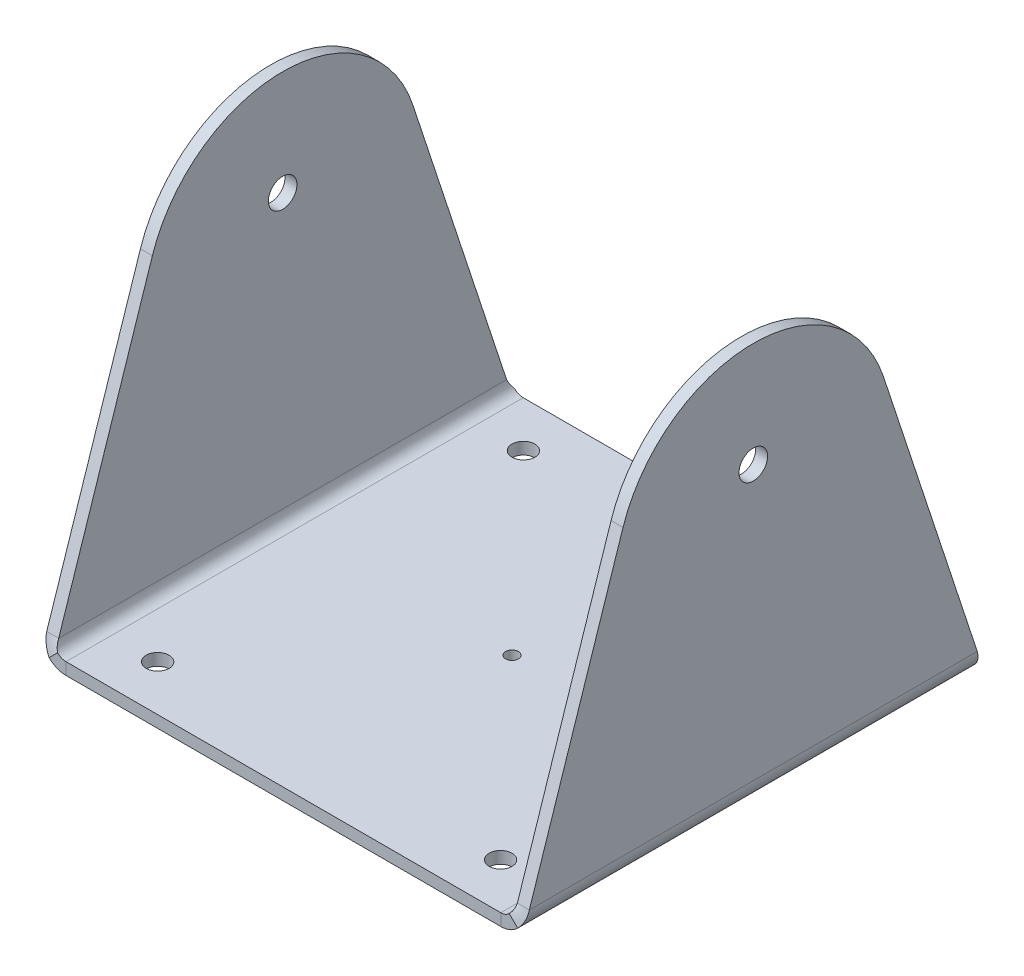
ISO-10303-21;
HEADER;
FILE_DESCRIPTION(('STEP AP214'),'2;1');
FILE_NAME('part.step','',(''),(''),'','','');
FILE_SCHEMA(('AUTOMOTIVE_DESIGN { 1 0 10303 214 1 1 1 1 }'));
ENDSEC;
DATA;
#1=APPLICATION_CONTEXT('core data for automotive mechanical design processes');
#2=APPLICATION_PROTOCOL_DEFINITION('international standard','automotive_design',2000,#1);
#3=PRODUCT_CONTEXT('',#1,'mechanical');
#4=PRODUCT('Part','Part','',(#3));
#5=PRODUCT_RELATED_PRODUCT_CATEGORY('part','',(#4));
#6=PRODUCT_DEFINITION_FORMATION('','',#4);
#7=PRODUCT_DEFINITION_CONTEXT('part definition',#1,'design');
#8=PRODUCT_DEFINITION('design','',#6,#7);
#9=PRODUCT_DEFINITION_SHAPE('','',#8);
#10=(LENGTH_UNIT() NAMED_UNIT(*) SI_UNIT(.MILLI.,.METRE.));
#11=(NAMED_UNIT(*) PLANE_ANGLE_UNIT() SI_UNIT($,.RADIAN.));
#12=(NAMED_UNIT(*) SI_UNIT($,.STERADIAN.) SOLID_ANGLE_UNIT());
#13=UNCERTAINTY_MEASURE_WITH_UNIT(LENGTH_MEASURE(1.E-05),#10,'distance_accuracy_value','');
#14=(GEOMETRIC_REPRESENTATION_CONTEXT(3) GLOBAL_UNCERTAINTY_ASSIGNED_CONTEXT((#13)) GLOBAL_UNIT_ASSIGNED_CONTEXT((#10,
#11,#12)) REPRESENTATION_CONTEXT('',''));
#15=CARTESIAN_POINT('',(0.,0.,0.));
#16=DIRECTION('',(0.,0.,1.));
#17=DIRECTION('',(1.,0.,0.));
#18=AXIS2_PLACEMENT_3D('',#15,#16,#17);
#19=CARTESIAN_POINT('',(-51.435,-2.65684,-50.8));
#20=DIRECTION('',(0.,0.,-1.));
#21=DIRECTION('',(-1.,0.,0.));
#22=AXIS2_PLACEMENT_3D('',#19,#20,#21);
#23=PLANE('',#22);
#24=DIRECTION('',(-1.,0.,0.));
#25=VECTOR('',#24,1.);
#26=CARTESIAN_POINT('',(-51.435,0.,-50.8));
#27=LINE('',#26,#25);
#28=CARTESIAN_POINT('',(48.3049841153387,0.,-50.8));
#29=VERTEX_POINT('',#28);
#30=CARTESIAN_POINT('',(-48.3049841153387,0.,-50.8));
#31=VERTEX_POINT('',#30);
#32=EDGE_CURVE('E95',#29,#31,#27,.T.);
#33=ORIENTED_EDGE('',*,*,#32,.F.);
#34=DIRECTION('',(0.,-1.,0.));
#35=VECTOR('',#34,1.);
#36=CARTESIAN_POINT('',(48.3049841153387,-2.65684,-50.8));
#37=LINE('',#36,#35);
#38=CARTESIAN_POINT('',(48.3049841153387,-2.65684,-50.8));
#39=VERTEX_POINT('',#38);
#40=EDGE_CURVE('E730',#29,#39,#37,.T.);
#41=ORIENTED_EDGE('',*,*,#40,.T.);
#42=DIRECTION('',(-1.,0.,0.));
#43=VECTOR('',#42,1.);
#44=CARTESIAN_POINT('',(-51.435,-2.65684,-50.8));
#45=LINE('',#44,#43);
#46=CARTESIAN_POINT('',(-48.3049841153387,-2.65684,-50.8));
#47=VERTEX_POINT('',#46);
#48=EDGE_CURVE('E672',#39,#47,#45,.T.);
#49=ORIENTED_EDGE('',*,*,#48,.T.);
#50=DIRECTION('',(0.,-1.,0.));
#51=VECTOR('',#50,1.);
#52=CARTESIAN_POINT('',(-48.3049841153387,-2.65684,-50.8));
#53=LINE('',#52,#51);
#54=EDGE_CURVE('E631',#31,#47,#53,.T.);
#55=ORIENTED_EDGE('',*,*,#54,.F.);
#56=EDGE_LOOP('',(#33,#41,#49,#55));
#57=FACE_BOUND('',#56,.T.);
#58=ADVANCED_FACE('F70',(#57),#23,.T.);
#59=CARTESIAN_POINT('',(-51.435,-2.65684,50.8));
#60=DIRECTION('',(0.,0.,1.));
#61=DIRECTION('',(1.,0.,0.));
#62=AXIS2_PLACEMENT_3D('',#59,#60,#61);
#63=PLANE('',#62);
#64=DIRECTION('',(1.,0.,0.));
#65=VECTOR('',#64,1.);
#66=CARTESIAN_POINT('',(-51.435,-2.65684,50.8));
#67=LINE('',#66,#65);
#68=CARTESIAN_POINT('',(-48.3049841153387,-2.65684,50.8));
#69=VERTEX_POINT('',#68);
#70=CARTESIAN_POINT('',(48.3049841153387,-2.65684,50.8));
#71=VERTEX_POINT('',#70);
#72=EDGE_CURVE('E663',#69,#71,#67,.T.);
#73=ORIENTED_EDGE('',*,*,#72,.T.);
#74=DIRECTION('',(0.,1.,0.));
#75=VECTOR('',#74,1.);
#76=CARTESIAN_POINT('',(48.3049841153387,-2.65684,50.8));
#77=LINE('',#76,#75);
#78=CARTESIAN_POINT('',(48.3049841153387,0.,50.8));
#79=VERTEX_POINT('',#78);
#80=EDGE_CURVE('E12',#71,#79,#77,.T.);
#81=ORIENTED_EDGE('',*,*,#80,.T.);
#82=DIRECTION('',(1.,0.,0.));
#83=VECTOR('',#82,1.);
#84=CARTESIAN_POINT('',(-51.435,0.,50.8));
#85=LINE('',#84,#83);
#86=CARTESIAN_POINT('',(-48.3049841153387,0.,50.8));
#87=VERTEX_POINT('',#86);
#88=EDGE_CURVE('E676',#87,#79,#85,.T.);
#89=ORIENTED_EDGE('',*,*,#88,.F.);
#90=DIRECTION('',(0.,1.,0.));
#91=VECTOR('',#90,1.);
#92=CARTESIAN_POINT('',(-48.3049841153386,-2.65684,50.8));
#93=LINE('',#92,#91);
#94=EDGE_CURVE('E628',#69,#87,#93,.T.);
#95=ORIENTED_EDGE('',*,*,#94,.F.);
#96=EDGE_LOOP('',(#73,#81,#89,#95));
#97=FACE_BOUND('',#96,.T.);
#98=ADVANCED_FACE('F723',(#97),#63,.T.);
#99=CARTESIAN_POINT('',(-108.245323885716,-2.65684,0.));
#100=DIRECTION('',(0.,-1.,0.));
#101=DIRECTION('',(0.,0.,-1.));
#102=AXIS2_PLACEMENT_3D('',#99,#100,#101);
#103=PLANE('',#102);
#104=CARTESIAN_POINT('',(0.,-2.65684,0.));
#105=DIRECTION('',(0.,-1.,0.));
#106=DIRECTION('',(0.,0.,-1.));
#107=AXIS2_PLACEMENT_3D('',#104,#105,#106);
#108=CIRCLE('',#107,1.4224);
#109=CARTESIAN_POINT('',(0.,-2.65684,-1.4224));
#110=VERTEX_POINT('',#109);
#111=EDGE_CURVE('E805',#110,#110,#108,.T.);
#112=ORIENTED_EDGE('',*,*,#111,.F.);
#113=EDGE_LOOP('',(#112));
#114=FACE_BOUND('',#113,.T.);
#115=CARTESIAN_POINT('',(38.1,-2.65684,-40.64));
#116=DIRECTION('',(0.,-1.,0.));
#117=DIRECTION('',(0.,0.,-1.));
#118=AXIS2_PLACEMENT_3D('',#115,#116,#117);
#119=CIRCLE('',#118,2.54);
#120=CARTESIAN_POINT('',(38.1,-2.65684,-43.18));
#121=VERTEX_POINT('',#120);
#122=EDGE_CURVE('E802',#121,#121,#119,.T.);
#123=ORIENTED_EDGE('',*,*,#122,.F.);
#124=EDGE_LOOP('',(#123));
#125=FACE_BOUND('',#124,.T.);
#126=CARTESIAN_POINT('',(38.1,-2.65684,40.64));
#127=DIRECTION('',(0.,-1.,0.));
#128=DIRECTION('',(0.,0.,-1.));
#129=AXIS2_PLACEMENT_3D('',#126,#127,#128);
#130=CIRCLE('',#129,2.54);
#131=CARTESIAN_POINT('',(38.1,-2.65684,38.1));
#132=VERTEX_POINT('',#131);
#133=EDGE_CURVE('E799',#132,#132,#130,.T.);
#134=ORIENTED_EDGE('',*,*,#133,.F.);
#135=EDGE_LOOP('',(#134));
#136=FACE_BOUND('',#135,.T.);
#137=CARTESIAN_POINT('',(-38.1,-2.65684,40.64));
#138=DIRECTION('',(0.,-1.,0.));
#139=DIRECTION('',(0.,0.,-1.));
#140=AXIS2_PLACEMENT_3D('',#137,#138,#139);
#141=CIRCLE('',#140,2.54);
#142=CARTESIAN_POINT('',(-38.1,-2.65684,38.1));
#143=VERTEX_POINT('',#142);
#144=EDGE_CURVE('E776',#143,#143,#141,.T.);
#145=ORIENTED_EDGE('',*,*,#144,.F.);
#146=EDGE_LOOP('',(#145));
#147=FACE_BOUND('',#146,.T.);
#148=CARTESIAN_POINT('',(-38.1,-2.65684,-40.64));
#149=DIRECTION('',(0.,-1.,0.));
#150=DIRECTION('',(0.,0.,-1.));
#151=AXIS2_PLACEMENT_3D('',#148,#149,#150);
#152=CIRCLE('',#151,2.54);
#153=CARTESIAN_POINT('',(-38.1,-2.65684,-43.18));
#154=VERTEX_POINT('',#153);
#155=EDGE_CURVE('E785',#154,#154,#152,.T.);
#156=ORIENTED_EDGE('',*,*,#155,.F.);
#157=EDGE_LOOP('',(#156));
#158=FACE_BOUND('',#157,.T.);
#159=ORIENTED_EDGE('',*,*,#48,.F.);
#160=DIRECTION('',(0.,0.,1.));
#161=VECTOR('',#160,1.);
#162=CARTESIAN_POINT('',(48.3049841153387,-2.65684,0.));
#163=LINE('',#162,#161);
#164=EDGE_CURVE('E431',#39,#71,#163,.T.);
#165=ORIENTED_EDGE('',*,*,#164,.T.);
#166=ORIENTED_EDGE('',*,*,#72,.F.);
#167=DIRECTION('',(0.,0.,1.));
#168=VECTOR('',#167,1.);
#169=CARTESIAN_POINT('',(-48.3049841153387,-2.65684,0.));
#170=LINE('',#169,#168);
#171=EDGE_CURVE('E662',#47,#69,#170,.T.);
#172=ORIENTED_EDGE('',*,*,#171,.F.);
#173=EDGE_LOOP('',(#159,#165,#166,#172));
#174=FACE_BOUND('',#173,.T.);
#175=ADVANCED_FACE('F728',(#114,#125,#136,#147,#158,#174),#103,.T.);
#176=CARTESIAN_POINT('',(-108.245323885716,0.,0.));
#177=DIRECTION('',(0.,-1.,0.));
#178=DIRECTION('',(0.,0.,-1.));
#179=AXIS2_PLACEMENT_3D('',#176,#177,#178);
#180=PLANE('',#179);
#181=CARTESIAN_POINT('',(0.,0.,0.));
#182=DIRECTION('',(0.,1.,0.));
#183=DIRECTION('',(0.,0.,1.));
#184=AXIS2_PLACEMENT_3D('',#181,#182,#183);
#185=CIRCLE('',#184,1.4224);
#186=CARTESIAN_POINT('',(0.,0.,1.4224));
#187=VERTEX_POINT('',#186);
#188=EDGE_CURVE('E793',#187,#187,#185,.T.);
#189=ORIENTED_EDGE('',*,*,#188,.F.);
#190=EDGE_LOOP('',(#189));
#191=FACE_BOUND('',#190,.T.);
#192=CARTESIAN_POINT('',(38.1,0.,-40.64));
#193=DIRECTION('',(0.,1.,0.));
#194=DIRECTION('',(0.,0.,1.));
#195=AXIS2_PLACEMENT_3D('',#192,#193,#194);
#196=CIRCLE('',#195,2.54);
#197=CARTESIAN_POINT('',(38.1,0.,-38.1));
#198=VERTEX_POINT('',#197);
#199=EDGE_CURVE('E788',#198,#198,#196,.T.);
#200=ORIENTED_EDGE('',*,*,#199,.F.);
#201=EDGE_LOOP('',(#200));
#202=FACE_BOUND('',#201,.T.);
#203=CARTESIAN_POINT('',(38.1,0.,40.64));
#204=DIRECTION('',(0.,1.,0.));
#205=DIRECTION('',(0.,0.,1.));
#206=AXIS2_PLACEMENT_3D('',#203,#204,#205);
#207=CIRCLE('',#206,2.54);
#208=CARTESIAN_POINT('',(38.1,0.,43.18));
#209=VERTEX_POINT('',#208);
#210=EDGE_CURVE('E782',#209,#209,#207,.T.);
#211=ORIENTED_EDGE('',*,*,#210,.F.);
#212=EDGE_LOOP('',(#211));
#213=FACE_BOUND('',#212,.T.);
#214=CARTESIAN_POINT('',(-38.1,0.,40.64));
#215=DIRECTION('',(0.,1.,0.));
#216=DIRECTION('',(0.,0.,1.));
#217=AXIS2_PLACEMENT_3D('',#214,#215,#216);
#218=CIRCLE('',#217,2.54);
#219=CARTESIAN_POINT('',(-38.1,0.,43.18));
#220=VERTEX_POINT('',#219);
#221=EDGE_CURVE('E779',#220,#220,#218,.T.);
#222=ORIENTED_EDGE('',*,*,#221,.F.);
#223=EDGE_LOOP('',(#222));
#224=FACE_BOUND('',#223,.T.);
#225=CARTESIAN_POINT('',(-38.1,0.,-40.64));
#226=DIRECTION('',(0.,1.,0.));
#227=DIRECTION('',(0.,0.,1.));
#228=AXIS2_PLACEMENT_3D('',#225,#226,#227);
#229=CIRCLE('',#228,2.54);
#230=CARTESIAN_POINT('',(-38.1,0.,-38.1));
#231=VERTEX_POINT('',#230);
#232=EDGE_CURVE('E781',#231,#231,#229,.T.);
#233=ORIENTED_EDGE('',*,*,#232,.F.);
#234=EDGE_LOOP('',(#233));
#235=FACE_BOUND('',#234,.T.);
#236=DIRECTION('',(0.,0.,1.));
#237=VECTOR('',#236,1.);
#238=CARTESIAN_POINT('',(48.3049841153387,0.,0.));
#239=LINE('',#238,#237);
#240=EDGE_CURVE('E79',#29,#79,#239,.T.);
#241=ORIENTED_EDGE('',*,*,#240,.F.);
#242=ORIENTED_EDGE('',*,*,#32,.T.);
#243=DIRECTION('',(0.,0.,1.));
#244=VECTOR('',#243,1.);
#245=CARTESIAN_POINT('',(-48.3049841153387,0.,0.));
#246=LINE('',#245,#244);
#247=EDGE_CURVE('E629',#31,#87,#246,.T.);
#248=ORIENTED_EDGE('',*,*,#247,.T.);
#249=ORIENTED_EDGE('',*,*,#88,.T.);
#250=EDGE_LOOP('',(#241,#242,#248,#249));
#251=FACE_BOUND('',#250,.T.);
#252=ADVANCED_FACE('F72',(#191,#202,#213,#224,#235,#251),#180,.F.);
#253=CARTESIAN_POINT('',(-53.6186641153387,2.65684,-49.7691780533468));
#254=CARTESIAN_POINT('',(-53.6186641153387,1.96116271819733,-49.9410109057097));
#255=CARTESIAN_POINT('',(-53.4803632478976,1.26599550183778,-50.1127853688979));
#256=CARTESIAN_POINT('',(-52.9480053714089,-0.0192301036172334,-50.4563926844489));
#257=CARTESIAN_POINT('',(-52.5542413998741,-0.608581037575227,-50.628167147637));
#258=CARTESIAN_POINT('',(-52.062323276394,-1.10049916105532,-50.8));
#259=CARTESIAN_POINT('',(-50.9618241153387,2.65684,-49.7691780533468));
#260=CARTESIAN_POINT('',(-50.9618241153387,2.30901005387616,-49.9410066104756));
#261=CARTESIAN_POINT('',(-50.8926736816181,1.96141775091889,-50.1127853688979));
#262=CARTESIAN_POINT('',(-50.6264947433738,1.31880494819138,-50.4563926844489));
#263=CARTESIAN_POINT('',(-50.4296066094703,1.02412333307626,-50.6281714428712));
#264=CARTESIAN_POINT('',(-50.1836536958663,0.778170419472337,-50.8));
#265=B_SPLINE_SURFACE_WITH_KNOTS('',1,3,((#253,#254,#255,#256,#257,#258),(#259,#260,#261,#262,
#263,#264)),.UNSPECIFIED.,.F.,.F.,.F.,(2,2),(4,2,4),(0.,1.),(0.,0.5,1.),.UNSPECIFIED.);
#266=CARTESIAN_POINT('',(-53.6186641153387,2.65684,-49.7691780533468));
#267=CARTESIAN_POINT('',(-50.9618241153387,2.65684,-49.7691780533468));
#268=B_SPLINE_CURVE_WITH_KNOTS('',1,(#266,#267),.UNSPECIFIED.,.F.,.F.,(2,2),(0.,1.),.UNSPECIFIED.);
#269=CARTESIAN_POINT('',(-50.9618241153387,2.65684000000001,-49.7691780533468));
#270=VERTEX_POINT('',#269);
#271=CARTESIAN_POINT('',(-53.6186641153387,2.65684000000003,-49.7691780533468));
#272=VERTEX_POINT('',#271);
#273=EDGE_CURVE('E415',#270,#272,#268,.F.);
#274=CARTESIAN_POINT('',(-50.9618241153387,2.65684,-49.7691780533468));
#275=CARTESIAN_POINT('',(-50.9618241153387,2.30901005387616,-49.9410066104756));
#276=CARTESIAN_POINT('',(-50.8926736816181,1.96141775091889,-50.1127853688979));
#277=CARTESIAN_POINT('',(-50.6264947433738,1.31880494819138,-50.4563926844489));
#278=CARTESIAN_POINT('',(-50.4296066094703,1.02412333307626,-50.6281714428712));
#279=CARTESIAN_POINT('',(-50.1836536958663,0.778170419472337,-50.8));
#280=B_SPLINE_CURVE_WITH_KNOTS('',3,(#274,#275,#276,#277,#278,#279),.UNSPECIFIED.,.F.,.F.,(4,2,
4),(0.,0.5,1.),.UNSPECIFIED.);
#281=CARTESIAN_POINT('',(-50.1836536958663,0.778170419472338,-50.8));
#282=VERTEX_POINT('',#281);
#283=EDGE_CURVE('E589',#270,#282,#280,.T.);
#284=CARTESIAN_POINT('',(-50.1836536958663,0.778170419472337,-50.8));
#285=CARTESIAN_POINT('',(-52.062323276394,-1.10049916105532,-50.8));
#286=B_SPLINE_CURVE_WITH_KNOTS('',1,(#284,#285),.UNSPECIFIED.,.F.,.F.,(2,2),(0.,1.),.UNSPECIFIED.);
#287=CARTESIAN_POINT('',(-52.062323276394,-1.10049916105532,-50.8));
#288=VERTEX_POINT('',#287);
#289=EDGE_CURVE('E625',#282,#288,#286,.T.);
#290=CARTESIAN_POINT('',(-52.062323276394,-1.10049916105532,-50.8));
#291=CARTESIAN_POINT('',(-52.5542413998741,-0.608581037575227,-50.628167147637));
#292=CARTESIAN_POINT('',(-52.9480053714089,-0.0192301036172334,-50.4563926844489));
#293=CARTESIAN_POINT('',(-53.4803632478976,1.26599550183778,-50.1127853688979));
#294=CARTESIAN_POINT('',(-53.6186641153387,1.96116271819733,-49.9410109057097));
#295=CARTESIAN_POINT('',(-53.6186641153387,2.65684,-49.7691780533468));
#296=B_SPLINE_CURVE_WITH_KNOTS('',3,(#290,#291,#292,#293,#294,#295),.UNSPECIFIED.,.F.,.F.,(4,2,
4),(0.,0.5,1.),.UNSPECIFIED.);
#297=EDGE_CURVE('E591',#272,#288,#296,.F.);
#298=ORIENTED_EDGE('',*,*,#273,.F.);
#299=ORIENTED_EDGE('',*,*,#283,.T.);
#300=ORIENTED_EDGE('',*,*,#289,.T.);
#301=ORIENTED_EDGE('',*,*,#297,.F.);
#302=EDGE_LOOP('',(#298,#299,#300,#301));
#303=FACE_BOUND('',#302,.T.);
#304=ADVANCED_FACE('F520',(#303),#265,.T.);
#305=CARTESIAN_POINT('',(-48.3049841153387,2.65684,-50.8));
#306=DIRECTION('',(0.,0.,-1.));
#307=DIRECTION('',(-1.,0.,0.));
#308=AXIS2_PLACEMENT_3D('',#305,#306,#307);
#309=PLANE('',#308);
#310=ORIENTED_EDGE('',*,*,#289,.F.);
#311=CARTESIAN_POINT('',(-48.3049841153387,2.65684,-50.8));
#312=DIRECTION('',(0.,0.,-1.));
#313=DIRECTION('',(-1.,0.,0.));
#314=AXIS2_PLACEMENT_3D('',#311,#312,#313);
#315=CIRCLE('',#314,2.65684);
#316=EDGE_CURVE('E498',#282,#31,#315,.F.);
#317=ORIENTED_EDGE('',*,*,#316,.T.);
#318=ORIENTED_EDGE('',*,*,#54,.T.);
#319=CARTESIAN_POINT('',(-48.3049841153387,2.65684,-50.8));
#320=DIRECTION('',(0.,0.,1.));
#321=DIRECTION('',(-1.,0.,0.));
#322=AXIS2_PLACEMENT_3D('',#319,#320,#321);
#323=CIRCLE('',#322,5.31368);
#324=EDGE_CURVE('E478',#288,#47,#323,.T.);
#325=ORIENTED_EDGE('',*,*,#324,.F.);
#326=EDGE_LOOP('',(#310,#317,#318,#325));
#327=FACE_BOUND('',#326,.T.);
#328=ADVANCED_FACE('F563',(#327),#309,.T.);
#329=CARTESIAN_POINT('',(-48.3049841153386,2.65684,50.8));
#330=DIRECTION('',(0.,0.,1.));
#331=DIRECTION('',(1.,0.,0.));
#332=AXIS2_PLACEMENT_3D('',#329,#330,#331);
#333=PLANE('',#332);
#334=ORIENTED_EDGE('',*,*,#94,.T.);
#335=CARTESIAN_POINT('',(-48.3049841153386,2.65684,50.8));
#336=DIRECTION('',(0.,0.,-1.));
#337=DIRECTION('',(-1.,0.,0.));
#338=AXIS2_PLACEMENT_3D('',#335,#336,#337);
#339=CIRCLE('',#338,2.65684);
#340=CARTESIAN_POINT('',(-50.1836536958663,0.778170419472338,50.8));
#341=VERTEX_POINT('',#340);
#342=EDGE_CURVE('E490',#87,#341,#339,.T.);
#343=ORIENTED_EDGE('',*,*,#342,.T.);
#344=CARTESIAN_POINT('',(-52.062323276394,-1.10049916105533,50.8));
#345=CARTESIAN_POINT('',(-50.1836536958663,0.778170419472335,50.8));
#346=B_SPLINE_CURVE_WITH_KNOTS('',1,(#344,#345),.UNSPECIFIED.,.F.,.F.,(2,2),(0.,1.),.UNSPECIFIED.);
#347=CARTESIAN_POINT('',(-52.062323276394,-1.10049916105533,50.8));
#348=VERTEX_POINT('',#347);
#349=EDGE_CURVE('E552',#341,#348,#346,.F.);
#350=ORIENTED_EDGE('',*,*,#349,.T.);
#351=CARTESIAN_POINT('',(-48.3049841153386,2.65684,50.8));
#352=DIRECTION('',(0.,0.,-1.));
#353=DIRECTION('',(1.,0.,0.));
#354=AXIS2_PLACEMENT_3D('',#351,#352,#353);
#355=CIRCLE('',#354,5.31368);
#356=EDGE_CURVE('E476',#69,#348,#355,.T.);
#357=ORIENTED_EDGE('',*,*,#356,.F.);
#358=EDGE_LOOP('',(#334,#343,#350,#357));
#359=FACE_BOUND('',#358,.T.);
#360=ADVANCED_FACE('F519',(#359),#333,.T.);
#361=CARTESIAN_POINT('',(-52.062323276394,-1.10049916105533,50.8));
#362=CARTESIAN_POINT('',(-52.5542413998741,-0.608581037575227,50.628167147637));
#363=CARTESIAN_POINT('',(-52.9480053714089,-0.0192301036172348,50.4563926844489));
#364=CARTESIAN_POINT('',(-53.4803632478975,1.26599550183779,50.1127853688978));
#365=CARTESIAN_POINT('',(-53.6186641153387,1.96116271819732,49.9410109057097));
#366=CARTESIAN_POINT('',(-53.6186641153387,2.65684,49.7691780533468));
#367=CARTESIAN_POINT('',(-50.1836536958663,0.778170419472335,50.8));
#368=CARTESIAN_POINT('',(-50.4296066094702,1.02412333307626,50.6281714428712));
#369=CARTESIAN_POINT('',(-50.6264947433738,1.31880494819138,50.4563926844489));
#370=CARTESIAN_POINT('',(-50.8926736816181,1.96141775091889,50.1127853688978));
#371=CARTESIAN_POINT('',(-50.9618241153387,2.30901005387616,49.9410066104755));
#372=CARTESIAN_POINT('',(-50.9618241153387,2.65684,49.7691780533468));
#373=B_SPLINE_SURFACE_WITH_KNOTS('',1,3,((#361,#362,#363,#364,#365,#366),(#367,#368,#369,#370,
#371,#372)),.UNSPECIFIED.,.F.,.F.,.F.,(2,2),(4,2,4),(0.,1.),(0.,0.5,1.),.UNSPECIFIED.);
#374=CARTESIAN_POINT('',(-50.1836536958663,0.778170419472335,50.8));
#375=CARTESIAN_POINT('',(-50.4296066094702,1.02412333307626,50.6281714428712));
#376=CARTESIAN_POINT('',(-50.6264947433738,1.31880494819138,50.4563926844489));
#377=CARTESIAN_POINT('',(-50.8926736816181,1.96141775091889,50.1127853688978));
#378=CARTESIAN_POINT('',(-50.9618241153387,2.30901005387616,49.9410066104755));
#379=CARTESIAN_POINT('',(-50.9618241153387,2.65684,49.7691780533468));
#380=B_SPLINE_CURVE_WITH_KNOTS('',3,(#374,#375,#376,#377,#378,#379),.UNSPECIFIED.,.F.,.F.,(4,2,
4),(0.,0.5,1.),.UNSPECIFIED.);
#381=CARTESIAN_POINT('',(-50.9618241153387,2.65684,49.7691780533468));
#382=VERTEX_POINT('',#381);
#383=EDGE_CURVE('E486',#341,#382,#380,.T.);
#384=CARTESIAN_POINT('',(-50.9618241153387,2.65684,49.7691780533468));
#385=CARTESIAN_POINT('',(-53.6186641153387,2.65684,49.7691780533468));
#386=B_SPLINE_CURVE_WITH_KNOTS('',1,(#384,#385),.UNSPECIFIED.,.F.,.F.,(2,2),(0.,1.),.UNSPECIFIED.);
#387=CARTESIAN_POINT('',(-53.6186641153387,2.65684000000004,49.7691780533468));
#388=VERTEX_POINT('',#387);
#389=EDGE_CURVE('E421',#388,#382,#386,.F.);
#390=CARTESIAN_POINT('',(-53.6186641153387,2.65684,49.7691780533468));
#391=CARTESIAN_POINT('',(-53.6186641153387,1.96116271819732,49.9410109057097));
#392=CARTESIAN_POINT('',(-53.4803632478975,1.26599550183779,50.1127853688978));
#393=CARTESIAN_POINT('',(-52.9480053714089,-0.0192301036172348,50.4563926844489));
#394=CARTESIAN_POINT('',(-52.5542413998741,-0.608581037575227,50.628167147637));
#395=CARTESIAN_POINT('',(-52.062323276394,-1.10049916105533,50.8));
#396=B_SPLINE_CURVE_WITH_KNOTS('',3,(#390,#391,#392,#393,#394,#395),.UNSPECIFIED.,.F.,.F.,(4,2,
4),(0.,0.5,1.),.UNSPECIFIED.);
#397=EDGE_CURVE('E475',#348,#388,#396,.F.);
#398=ORIENTED_EDGE('',*,*,#383,.T.);
#399=ORIENTED_EDGE('',*,*,#389,.F.);
#400=ORIENTED_EDGE('',*,*,#397,.F.);
#401=ORIENTED_EDGE('',*,*,#349,.F.);
#402=EDGE_LOOP('',(#398,#399,#400,#401));
#403=FACE_BOUND('',#402,.T.);
#404=ADVANCED_FACE('F446',(#403),#373,.T.);
#405=CARTESIAN_POINT('',(-48.3049841153386,2.65684,101.827338158957));
#406=DIRECTION('',(0.,0.,-1.));
#407=DIRECTION('',(-1.,0.,0.));
#408=AXIS2_PLACEMENT_3D('',#405,#406,#407);
#409=CYLINDRICAL_SURFACE('',#408,5.31368);
#410=ORIENTED_EDGE('',*,*,#356,.T.);
#411=ORIENTED_EDGE('',*,*,#397,.T.);
#412=DIRECTION('',(0.,0.,1.));
#413=VECTOR('',#412,1.);
#414=CARTESIAN_POINT('',(-53.6186641153387,2.65684000000001,0.));
#415=LINE('',#414,#413);
#416=EDGE_CURVE('E640',#272,#388,#415,.T.);
#417=ORIENTED_EDGE('',*,*,#416,.F.);
#418=ORIENTED_EDGE('',*,*,#297,.T.);
#419=ORIENTED_EDGE('',*,*,#324,.T.);
#420=ORIENTED_EDGE('',*,*,#171,.T.);
#421=EDGE_LOOP('',(#410,#411,#417,#418,#419,#420));
#422=FACE_BOUND('',#421,.T.);
#423=ADVANCED_FACE('F442',(#422),#409,.T.);
#424=CARTESIAN_POINT('',(-48.3049841153386,2.65684,101.827338158957));
#425=DIRECTION('',(0.,0.,-1.));
#426=DIRECTION('',(-1.,0.,0.));
#427=AXIS2_PLACEMENT_3D('',#424,#425,#426);
#428=CYLINDRICAL_SURFACE('',#427,2.65684);
#429=ORIENTED_EDGE('',*,*,#342,.F.);
#430=ORIENTED_EDGE('',*,*,#247,.F.);
#431=ORIENTED_EDGE('',*,*,#316,.F.);
#432=ORIENTED_EDGE('',*,*,#283,.F.);
#433=DIRECTION('',(0.,0.,1.));
#434=VECTOR('',#433,1.);
#435=CARTESIAN_POINT('',(-50.9618241153387,2.65684000000001,0.));
#436=LINE('',#435,#434);
#437=EDGE_CURVE('E402',#270,#382,#436,.T.);
#438=ORIENTED_EDGE('',*,*,#437,.T.);
#439=ORIENTED_EDGE('',*,*,#383,.F.);
#440=EDGE_LOOP('',(#429,#430,#431,#432,#438,#439));
#441=FACE_BOUND('',#440,.T.);
#442=ADVANCED_FACE('F383',(#441),#428,.F.);
#443=CARTESIAN_POINT('',(-53.6186641153385,56.3371480010551,0.));
#444=DIRECTION('',(1.,0.,0.));
#445=DIRECTION('',(0.,0.,1.));
#446=AXIS2_PLACEMENT_3D('',#443,#444,#445);
#447=CYLINDRICAL_SURFACE('',#446,30.48);
#448=CARTESIAN_POINT('',(-50.9618241153385,56.3371480010551,0.));
#449=DIRECTION('',(1.,0.,0.));
#450=DIRECTION('',(0.,0.,-1.));
#451=AXIS2_PLACEMENT_3D('',#448,#449,#450);
#452=CIRCLE('',#451,30.48);
#453=CARTESIAN_POINT('',(-50.9618241153385,65.8715144108933,-28.9504103107874));
#454=VERTEX_POINT('',#453);
#455=CARTESIAN_POINT('',(-50.9618241153384,65.8715144108933,28.9504103107875));
#456=VERTEX_POINT('',#455);
#457=EDGE_CURVE('E416',#454,#456,#452,.T.);
#458=ORIENTED_EDGE('',*,*,#457,.F.);
#459=DIRECTION('',(1.,0.,0.));
#460=VECTOR('',#459,1.);
#461=CARTESIAN_POINT('',(-53.6186641153384,65.8715144108934,-28.9504103107874));
#462=LINE('',#461,#460);
#463=CARTESIAN_POINT('',(-53.6186641153384,65.8715144108934,-28.9504103107874));
#464=VERTEX_POINT('',#463);
#465=EDGE_CURVE('E369',#464,#454,#462,.T.);
#466=ORIENTED_EDGE('',*,*,#465,.F.);
#467=CARTESIAN_POINT('',(-53.6186641153385,56.3371480010551,0.));
#468=DIRECTION('',(1.,0.,0.));
#469=DIRECTION('',(0.,0.,-1.));
#470=AXIS2_PLACEMENT_3D('',#467,#468,#469);
#471=CIRCLE('',#470,30.48);
#472=CARTESIAN_POINT('',(-53.6186641153384,65.8715144108933,28.9504103107875));
#473=VERTEX_POINT('',#472);
#474=EDGE_CURVE('E410',#464,#473,#471,.T.);
#475=ORIENTED_EDGE('',*,*,#474,.T.);
#476=DIRECTION('',(1.,0.,0.));
#477=VECTOR('',#476,1.);
#478=CARTESIAN_POINT('',(-53.6186641153384,65.8715144108933,28.9504103107875));
#479=LINE('',#478,#477);
#480=EDGE_CURVE('E639',#473,#456,#479,.T.);
#481=ORIENTED_EDGE('',*,*,#480,.T.);
#482=EDGE_LOOP('',(#458,#466,#475,#481));
#483=FACE_BOUND('',#482,.T.);
#484=ADVANCED_FACE('F379',(#483),#447,.T.);
#485=CARTESIAN_POINT('',(-53.6186641153385,56.3371480010551,0.));
#486=DIRECTION('',(-1.,0.,0.));
#487=DIRECTION('',(0.,0.,-1.));
#488=AXIS2_PLACEMENT_3D('',#485,#486,#487);
#489=PLANE('',#488);
#490=CARTESIAN_POINT('',(-53.6186641153384,63.4999999999996,0.));
#491=DIRECTION('',(-1.,0.,0.));
#492=DIRECTION('',(0.,-1.,0.));
#493=AXIS2_PLACEMENT_3D('',#490,#491,#492);
#494=CIRCLE('',#493,3.175);
#495=CARTESIAN_POINT('',(-53.6186641153385,60.3249999999996,0.));
#496=VERTEX_POINT('',#495);
#497=EDGE_CURVE('E686',#496,#496,#494,.T.);
#498=ORIENTED_EDGE('',*,*,#497,.F.);
#499=EDGE_LOOP('',(#498));
#500=FACE_BOUND('',#499,.T.);
#501=DIRECTION('',(0.,0.949816611246308,0.312807296910702));
#502=VECTOR('',#501,1.);
#503=CARTESIAN_POINT('',(-53.6186641153387,-0.473175884661302,-50.8));
#504=LINE('',#503,#502);
#505=EDGE_CURVE('E593',#272,#464,#504,.T.);
#506=ORIENTED_EDGE('',*,*,#505,.F.);
#507=ORIENTED_EDGE('',*,*,#416,.T.);
#508=DIRECTION('',(0.,-0.949816611246308,0.312807296910701));
#509=VECTOR('',#508,1.);
#510=CARTESIAN_POINT('',(-53.6186641153384,65.8715144108933,28.9504103107875));
#511=LINE('',#510,#509);
#512=EDGE_CURVE('E650',#473,#388,#511,.T.);
#513=ORIENTED_EDGE('',*,*,#512,.F.);
#514=ORIENTED_EDGE('',*,*,#474,.F.);
#515=EDGE_LOOP('',(#506,#507,#513,#514));
#516=FACE_BOUND('',#515,.T.);
#517=ADVANCED_FACE('F382',(#500,#516),#489,.T.);
#518=CARTESIAN_POINT('',(-53.6186641153384,65.8715144108933,28.9504103107875));
#519=DIRECTION('',(0.,0.312807296910701,0.949816611246308));
#520=DIRECTION('',(0.,-0.949816611246308,0.312807296910701));
#521=AXIS2_PLACEMENT_3D('',#518,#519,#520);
#522=PLANE('',#521);
#523=ORIENTED_EDGE('',*,*,#512,.T.);
#524=ORIENTED_EDGE('',*,*,#389,.T.);
#525=DIRECTION('',(0.,-0.949816611246308,0.312807296910701));
#526=VECTOR('',#525,1.);
#527=CARTESIAN_POINT('',(-50.9618241153384,65.8715144108933,28.9504103107875));
#528=LINE('',#527,#526);
#529=EDGE_CURVE('E413',#456,#382,#528,.T.);
#530=ORIENTED_EDGE('',*,*,#529,.F.);
#531=ORIENTED_EDGE('',*,*,#480,.F.);
#532=EDGE_LOOP('',(#523,#524,#530,#531));
#533=FACE_BOUND('',#532,.T.);
#534=ADVANCED_FACE('F387',(#533),#522,.T.);
#535=CARTESIAN_POINT('',(-50.9618241153385,56.3371480010551,0.));
#536=DIRECTION('',(-1.,0.,0.));
#537=DIRECTION('',(0.,0.,-1.));
#538=AXIS2_PLACEMENT_3D('',#535,#536,#537);
#539=PLANE('',#538);
#540=CARTESIAN_POINT('',(-50.9618241153385,63.4999999999997,0.));
#541=DIRECTION('',(-1.,0.,0.));
#542=DIRECTION('',(0.,-1.,0.));
#543=AXIS2_PLACEMENT_3D('',#540,#541,#542);
#544=CIRCLE('',#543,3.175);
#545=CARTESIAN_POINT('',(-50.9618241153385,60.3249999999997,0.));
#546=VERTEX_POINT('',#545);
#547=EDGE_CURVE('E811',#546,#546,#544,.T.);
#548=ORIENTED_EDGE('',*,*,#547,.T.);
#549=EDGE_LOOP('',(#548));
#550=FACE_BOUND('',#549,.T.);
#551=ORIENTED_EDGE('',*,*,#437,.F.);
#552=DIRECTION('',(0.,0.949816611246308,0.312807296910702));
#553=VECTOR('',#552,1.);
#554=CARTESIAN_POINT('',(-50.9618241153387,-0.473175884661309,-50.8));
#555=LINE('',#554,#553);
#556=EDGE_CURVE('E419',#270,#454,#555,.T.);
#557=ORIENTED_EDGE('',*,*,#556,.T.);
#558=ORIENTED_EDGE('',*,*,#457,.T.);
#559=ORIENTED_EDGE('',*,*,#529,.T.);
#560=EDGE_LOOP('',(#551,#557,#558,#559));
#561=FACE_BOUND('',#560,.T.);
#562=ADVANCED_FACE('F392',(#550,#561),#539,.F.);
#563=CARTESIAN_POINT('',(-53.6186641153387,-0.473175884661302,-50.8));
#564=DIRECTION('',(0.,0.312807296910702,-0.949816611246308));
#565=DIRECTION('',(0.,0.949816611246308,0.312807296910702));
#566=AXIS2_PLACEMENT_3D('',#563,#564,#565);
#567=PLANE('',#566);
#568=ORIENTED_EDGE('',*,*,#556,.F.);
#569=ORIENTED_EDGE('',*,*,#273,.T.);
#570=ORIENTED_EDGE('',*,*,#505,.T.);
#571=ORIENTED_EDGE('',*,*,#465,.T.);
#572=EDGE_LOOP('',(#568,#569,#570,#571));
#573=FACE_BOUND('',#572,.T.);
#574=ADVANCED_FACE('F433',(#573),#567,.T.);
#575=CARTESIAN_POINT('',(48.3049841153386,2.65684,-50.8));
#576=DIRECTION('',(0.,0.,-1.));
#577=DIRECTION('',(-1.,0.,0.));
#578=AXIS2_PLACEMENT_3D('',#575,#576,#577);
#579=PLANE('',#578);
#580=ORIENTED_EDGE('',*,*,#40,.F.);
#581=CARTESIAN_POINT('',(48.3049841153387,2.65684,-50.8));
#582=DIRECTION('',(0.,0.,1.));
#583=DIRECTION('',(1.,0.,0.));
#584=AXIS2_PLACEMENT_3D('',#581,#582,#583);
#585=CIRCLE('',#584,2.65684);
#586=CARTESIAN_POINT('',(50.1836536958663,0.778170419472345,-50.8));
#587=VERTEX_POINT('',#586);
#588=EDGE_CURVE('E205',#29,#587,#585,.T.);
#589=ORIENTED_EDGE('',*,*,#588,.T.);
#590=CARTESIAN_POINT('',(52.062323276394,-1.10049916105531,-50.8));
#591=CARTESIAN_POINT('',(50.1836536958663,0.778170419472344,-50.8));
#592=B_SPLINE_CURVE_WITH_KNOTS('',1,(#590,#591),.UNSPECIFIED.,.F.,.F.,(2,2),(0.,1.),.UNSPECIFIED.);
#593=CARTESIAN_POINT('',(52.062323276394,-1.10049916105531,-50.8));
#594=VERTEX_POINT('',#593);
#595=EDGE_CURVE('E334',#587,#594,#592,.F.);
#596=ORIENTED_EDGE('',*,*,#595,.T.);
#597=CARTESIAN_POINT('',(48.3049841153386,2.65684,-50.8));
#598=DIRECTION('',(0.,0.,1.));
#599=DIRECTION('',(-1.,0.,0.));
#600=AXIS2_PLACEMENT_3D('',#597,#598,#599);
#601=CIRCLE('',#600,5.31368);
#602=EDGE_CURVE('E260',#39,#594,#601,.T.);
#603=ORIENTED_EDGE('',*,*,#602,.F.);
#604=EDGE_LOOP('',(#580,#589,#596,#603));
#605=FACE_BOUND('',#604,.T.);
#606=ADVANCED_FACE('F302',(#605),#579,.T.);
#607=CARTESIAN_POINT('',(52.062323276394,-1.10049916105531,-50.8));
#608=CARTESIAN_POINT('',(52.5542413998741,-0.608581037575218,-50.6281671476371));
#609=CARTESIAN_POINT('',(52.9480053714089,-0.0192301036172221,-50.4563926844489));
#610=CARTESIAN_POINT('',(53.4803632478976,1.26599550183779,-50.1127853688979));
#611=CARTESIAN_POINT('',(53.6186641153387,1.96116271819733,-49.9410109057097));
#612=CARTESIAN_POINT('',(53.6186641153387,2.65684,-49.7691780533468));
#613=CARTESIAN_POINT('',(50.1836536958663,0.778170419472344,-50.8));
#614=CARTESIAN_POINT('',(50.4296066094703,1.02412333307628,-50.6281714428712));
#615=CARTESIAN_POINT('',(50.6264947433738,1.31880494819139,-50.4563926844489));
#616=CARTESIAN_POINT('',(50.8926736816181,1.96141775091889,-50.1127853688979));
#617=CARTESIAN_POINT('',(50.9618241153387,2.30901005387615,-49.9410066104756));
#618=CARTESIAN_POINT('',(50.9618241153387,2.65684,-49.7691780533468));
#619=B_SPLINE_SURFACE_WITH_KNOTS('',1,3,((#607,#608,#609,#610,#611,#612),(#613,#614,#615,#616,
#617,#618)),.UNSPECIFIED.,.F.,.F.,.F.,(2,2),(4,2,4),(0.,1.),(0.,0.5,1.),.UNSPECIFIED.);
#620=CARTESIAN_POINT('',(50.1836536958663,0.778170419472344,-50.8));
#621=CARTESIAN_POINT('',(50.4296066094703,1.02412333307628,-50.6281714428712));
#622=CARTESIAN_POINT('',(50.6264947433738,1.31880494819139,-50.4563926844489));
#623=CARTESIAN_POINT('',(50.8926736816181,1.96141775091889,-50.1127853688979));
#624=CARTESIAN_POINT('',(50.9618241153387,2.30901005387615,-49.9410066104756));
#625=CARTESIAN_POINT('',(50.9618241153387,2.65684,-49.7691780533468));
#626=B_SPLINE_CURVE_WITH_KNOTS('',3,(#620,#621,#622,#623,#624,#625),.UNSPECIFIED.,.F.,.F.,(4,2,
4),(0.,0.5,1.),.UNSPECIFIED.);
#627=CARTESIAN_POINT('',(50.9618241153387,2.65684000000002,-49.7691780533468));
#628=VERTEX_POINT('',#627);
#629=EDGE_CURVE('E270',#587,#628,#626,.T.);
#630=CARTESIAN_POINT('',(50.9618241153387,2.65684,-49.7691780533468));
#631=CARTESIAN_POINT('',(53.6186641153387,2.65684,-49.7691780533468));
#632=B_SPLINE_CURVE_WITH_KNOTS('',1,(#630,#631),.UNSPECIFIED.,.F.,.F.,(2,2),(0.,1.),.UNSPECIFIED.);
#633=CARTESIAN_POINT('',(53.6186641153387,2.65684000000003,-49.7691780533468));
#634=VERTEX_POINT('',#633);
#635=EDGE_CURVE('E212',#628,#634,#632,.T.);
#636=CARTESIAN_POINT('',(53.6186641153387,2.65684,-49.7691780533468));
#637=CARTESIAN_POINT('',(53.6186641153387,1.96116271819733,-49.9410109057097));
#638=CARTESIAN_POINT('',(53.4803632478976,1.26599550183779,-50.1127853688979));
#639=CARTESIAN_POINT('',(52.9480053714089,-0.0192301036172221,-50.4563926844489));
#640=CARTESIAN_POINT('',(52.5542413998741,-0.608581037575218,-50.6281671476371));
#641=CARTESIAN_POINT('',(52.062323276394,-1.10049916105531,-50.8));
#642=B_SPLINE_CURVE_WITH_KNOTS('',3,(#636,#637,#638,#639,#640,#641),.UNSPECIFIED.,.F.,.F.,(4,2,
4),(0.,0.5,1.),.UNSPECIFIED.);
#643=EDGE_CURVE('E259',#594,#634,#642,.F.);
#644=ORIENTED_EDGE('',*,*,#595,.F.);
#645=ORIENTED_EDGE('',*,*,#629,.T.);
#646=ORIENTED_EDGE('',*,*,#635,.T.);
#647=ORIENTED_EDGE('',*,*,#643,.F.);
#648=EDGE_LOOP('',(#644,#645,#646,#647));
#649=FACE_BOUND('',#648,.T.);
#650=ADVANCED_FACE('F290',(#649),#619,.T.);
#651=CARTESIAN_POINT('',(53.6186641153387,2.65684,49.7691780533468));
#652=CARTESIAN_POINT('',(53.6186641153387,1.96116271819733,49.9410109057097));
#653=CARTESIAN_POINT('',(53.4803632478976,1.26599550183779,50.1127853688979));
#654=CARTESIAN_POINT('',(52.9480053714089,-0.0192301036172277,50.4563926844489));
#655=CARTESIAN_POINT('',(52.5542413998741,-0.608581037575231,50.6281671476371));
#656=CARTESIAN_POINT('',(52.062323276394,-1.10049916105532,50.8));
#657=CARTESIAN_POINT('',(50.9618241153387,2.65684,49.7691780533468));
#658=CARTESIAN_POINT('',(50.9618241153387,2.30901005387614,49.9410066104756));
#659=CARTESIAN_POINT('',(50.8926736816181,1.96141775091889,50.1127853688979));
#660=CARTESIAN_POINT('',(50.6264947433738,1.31880494819139,50.4563926844489));
#661=CARTESIAN_POINT('',(50.4296066094703,1.02412333307626,50.6281714428712));
#662=CARTESIAN_POINT('',(50.1836536958664,0.77817041947234,50.8));
#663=B_SPLINE_SURFACE_WITH_KNOTS('',1,3,((#651,#652,#653,#654,#655,#656),(#657,#658,#659,#660,
#661,#662)),.UNSPECIFIED.,.F.,.F.,.F.,(2,2),(4,2,4),(0.,1.),(0.,0.5,1.),.UNSPECIFIED.);
#664=CARTESIAN_POINT('',(53.6186641153387,2.65684,49.7691780533468));
#665=CARTESIAN_POINT('',(50.9618241153387,2.65684,49.7691780533468));
#666=B_SPLINE_CURVE_WITH_KNOTS('',1,(#664,#665),.UNSPECIFIED.,.F.,.F.,(2,2),(0.,1.),.UNSPECIFIED.);
#667=CARTESIAN_POINT('',(53.6186641153387,2.65684000000001,49.7691780533468));
#668=VERTEX_POINT('',#667);
#669=CARTESIAN_POINT('',(50.9618241153387,2.65684,49.7691780533468));
#670=VERTEX_POINT('',#669);
#671=EDGE_CURVE('E193',#668,#670,#666,.T.);
#672=CARTESIAN_POINT('',(50.9618241153387,2.65684,49.7691780533468));
#673=CARTESIAN_POINT('',(50.9618241153387,2.30901005387614,49.9410066104756));
#674=CARTESIAN_POINT('',(50.8926736816181,1.96141775091889,50.1127853688979));
#675=CARTESIAN_POINT('',(50.6264947433738,1.31880494819139,50.4563926844489));
#676=CARTESIAN_POINT('',(50.4296066094703,1.02412333307626,50.6281714428712));
#677=CARTESIAN_POINT('',(50.1836536958664,0.77817041947234,50.8));
#678=B_SPLINE_CURVE_WITH_KNOTS('',3,(#672,#673,#674,#675,#676,#677),.UNSPECIFIED.,.F.,.F.,(4,2,
4),(0.,0.5,1.),.UNSPECIFIED.);
#679=CARTESIAN_POINT('',(50.1836536958664,0.778170419472341,50.8));
#680=VERTEX_POINT('',#679);
#681=EDGE_CURVE('E737',#670,#680,#678,.T.);
#682=CARTESIAN_POINT('',(50.1836536958664,0.77817041947234,50.8));
#683=CARTESIAN_POINT('',(52.062323276394,-1.10049916105532,50.8));
#684=B_SPLINE_CURVE_WITH_KNOTS('',1,(#682,#683),.UNSPECIFIED.,.F.,.F.,(2,2),(0.,1.),.UNSPECIFIED.);
#685=CARTESIAN_POINT('',(52.062323276394,-1.10049916105532,50.8));
#686=VERTEX_POINT('',#685);
#687=EDGE_CURVE('E355',#680,#686,#684,.T.);
#688=CARTESIAN_POINT('',(52.062323276394,-1.10049916105532,50.8));
#689=CARTESIAN_POINT('',(52.5542413998741,-0.608581037575231,50.6281671476371));
#690=CARTESIAN_POINT('',(52.9480053714089,-0.0192301036172277,50.4563926844489));
#691=CARTESIAN_POINT('',(53.4803632478976,1.26599550183779,50.1127853688979));
#692=CARTESIAN_POINT('',(53.6186641153387,1.96116271819733,49.9410109057097));
#693=CARTESIAN_POINT('',(53.6186641153387,2.65684,49.7691780533468));
#694=B_SPLINE_CURVE_WITH_KNOTS('',3,(#688,#689,#690,#691,#692,#693),.UNSPECIFIED.,.F.,.F.,(4,2,
4),(0.,0.5,1.),.UNSPECIFIED.);
#695=EDGE_CURVE('E839',#668,#686,#694,.F.);
#696=ORIENTED_EDGE('',*,*,#671,.T.);
#697=ORIENTED_EDGE('',*,*,#681,.T.);
#698=ORIENTED_EDGE('',*,*,#687,.T.);
#699=ORIENTED_EDGE('',*,*,#695,.F.);
#700=EDGE_LOOP('',(#696,#697,#698,#699));
#701=FACE_BOUND('',#700,.T.);
#702=ADVANCED_FACE('F301',(#701),#663,.T.);
#703=CARTESIAN_POINT('',(48.3049841153387,2.65684,50.8));
#704=DIRECTION('',(0.,0.,1.));
#705=DIRECTION('',(1.,0.,0.));
#706=AXIS2_PLACEMENT_3D('',#703,#704,#705);
#707=PLANE('',#706);
#708=CARTESIAN_POINT('',(48.3049841153387,2.65684,50.8));
#709=DIRECTION('',(0.,0.,1.));
#710=DIRECTION('',(1.,0.,0.));
#711=AXIS2_PLACEMENT_3D('',#708,#709,#710);
#712=CIRCLE('',#711,2.65684);
#713=EDGE_CURVE('E87',#680,#79,#712,.F.);
#714=ORIENTED_EDGE('',*,*,#713,.T.);
#715=ORIENTED_EDGE('',*,*,#80,.F.);
#716=CARTESIAN_POINT('',(48.3049841153387,2.65684,50.8));
#717=DIRECTION('',(0.,0.,-1.));
#718=DIRECTION('',(1.,0.,0.));
#719=AXIS2_PLACEMENT_3D('',#716,#717,#718);
#720=CIRCLE('',#719,5.31368);
#721=EDGE_CURVE('E735',#686,#71,#720,.T.);
#722=ORIENTED_EDGE('',*,*,#721,.F.);
#723=ORIENTED_EDGE('',*,*,#687,.F.);
#724=EDGE_LOOP('',(#714,#715,#722,#723));
#725=FACE_BOUND('',#724,.T.);
#726=ADVANCED_FACE('F235',(#725),#707,.T.);
#727=CARTESIAN_POINT('',(48.3049841153386,2.65684,-101.827338158957));
#728=DIRECTION('',(0.,0.,1.));
#729=DIRECTION('',(1.,0.,0.));
#730=AXIS2_PLACEMENT_3D('',#727,#728,#729);
#731=CYLINDRICAL_SURFACE('',#730,5.31368);
#732=ORIENTED_EDGE('',*,*,#695,.T.);
#733=ORIENTED_EDGE('',*,*,#721,.T.);
#734=ORIENTED_EDGE('',*,*,#164,.F.);
#735=ORIENTED_EDGE('',*,*,#602,.T.);
#736=ORIENTED_EDGE('',*,*,#643,.T.);
#737=DIRECTION('',(0.,0.,1.));
#738=VECTOR('',#737,1.);
#739=CARTESIAN_POINT('',(53.6186641153387,2.65684000000003,0.));
#740=LINE('',#739,#738);
#741=EDGE_CURVE('E684',#634,#668,#740,.T.);
#742=ORIENTED_EDGE('',*,*,#741,.T.);
#743=EDGE_LOOP('',(#732,#733,#734,#735,#736,#742));
#744=FACE_BOUND('',#743,.T.);
#745=ADVANCED_FACE('F224',(#744),#731,.T.);
#746=CARTESIAN_POINT('',(48.3049841153386,2.65684,-101.827338158957));
#747=DIRECTION('',(0.,0.,1.));
#748=DIRECTION('',(1.,0.,0.));
#749=AXIS2_PLACEMENT_3D('',#746,#747,#748);
#750=CYLINDRICAL_SURFACE('',#749,2.65684);
#751=ORIENTED_EDGE('',*,*,#681,.F.);
#752=DIRECTION('',(0.,0.,1.));
#753=VECTOR('',#752,1.);
#754=CARTESIAN_POINT('',(50.9618241153387,2.65684000000002,0.));
#755=LINE('',#754,#753);
#756=EDGE_CURVE('E701',#628,#670,#755,.T.);
#757=ORIENTED_EDGE('',*,*,#756,.F.);
#758=ORIENTED_EDGE('',*,*,#629,.F.);
#759=ORIENTED_EDGE('',*,*,#588,.F.);
#760=ORIENTED_EDGE('',*,*,#240,.T.);
#761=ORIENTED_EDGE('',*,*,#713,.F.);
#762=EDGE_LOOP('',(#751,#757,#758,#759,#760,#761));
#763=FACE_BOUND('',#762,.T.);
#764=ADVANCED_FACE('F234',(#763),#750,.F.);
#765=CARTESIAN_POINT('',(53.6186641153385,56.3371480010551,0.));
#766=DIRECTION('',(-1.,0.,0.));
#767=DIRECTION('',(0.,0.,1.));
#768=AXIS2_PLACEMENT_3D('',#765,#766,#767);
#769=CYLINDRICAL_SURFACE('',#768,30.48);
#770=CARTESIAN_POINT('',(50.9618241153385,56.3371480010551,0.));
#771=DIRECTION('',(-1.,0.,0.));
#772=DIRECTION('',(0.,0.,1.));
#773=AXIS2_PLACEMENT_3D('',#770,#771,#772);
#774=CIRCLE('',#773,30.48);
#775=CARTESIAN_POINT('',(50.9618241153385,65.8715144108933,28.9504103107875));
#776=VERTEX_POINT('',#775);
#777=CARTESIAN_POINT('',(50.9618241153384,65.8715144108933,-28.9504103107875));
#778=VERTEX_POINT('',#777);
#779=EDGE_CURVE('E198',#776,#778,#774,.T.);
#780=ORIENTED_EDGE('',*,*,#779,.F.);
#781=DIRECTION('',(-1.,0.,0.));
#782=VECTOR('',#781,1.);
#783=CARTESIAN_POINT('',(53.6186641153385,65.8715144108933,28.9504103107875));
#784=LINE('',#783,#782);
#785=CARTESIAN_POINT('',(53.6186641153385,65.8715144108933,28.9504103107875));
#786=VERTEX_POINT('',#785);
#787=EDGE_CURVE('E190',#786,#776,#784,.T.);
#788=ORIENTED_EDGE('',*,*,#787,.F.);
#789=CARTESIAN_POINT('',(53.6186641153385,56.3371480010551,0.));
#790=DIRECTION('',(-1.,0.,0.));
#791=DIRECTION('',(0.,0.,1.));
#792=AXIS2_PLACEMENT_3D('',#789,#790,#791);
#793=CIRCLE('',#792,30.48);
#794=CARTESIAN_POINT('',(53.6186641153384,65.8715144108933,-28.9504103107875));
#795=VERTEX_POINT('',#794);
#796=EDGE_CURVE('E203',#786,#795,#793,.T.);
#797=ORIENTED_EDGE('',*,*,#796,.T.);
#798=DIRECTION('',(-1.,0.,0.));
#799=VECTOR('',#798,1.);
#800=CARTESIAN_POINT('',(53.6186641153384,65.8715144108933,-28.9504103107875));
#801=LINE('',#800,#799);
#802=EDGE_CURVE('E211',#795,#778,#801,.T.);
#803=ORIENTED_EDGE('',*,*,#802,.T.);
#804=EDGE_LOOP('',(#780,#788,#797,#803));
#805=FACE_BOUND('',#804,.T.);
#806=ADVANCED_FACE('F202',(#805),#769,.T.);
#807=CARTESIAN_POINT('',(53.6186641153392,-160.153499770378,0.));
#808=DIRECTION('',(1.,0.,0.));
#809=DIRECTION('',(0.,0.,-1.));
#810=AXIS2_PLACEMENT_3D('',#807,#808,#809);
#811=PLANE('',#810);
#812=CARTESIAN_POINT('',(53.6186641153384,63.5,0.));
#813=DIRECTION('',(1.,0.,0.));
#814=DIRECTION('',(0.,1.,0.));
#815=AXIS2_PLACEMENT_3D('',#812,#813,#814);
#816=CIRCLE('',#815,3.175);
#817=CARTESIAN_POINT('',(53.6186641153384,66.675,0.));
#818=VERTEX_POINT('',#817);
#819=EDGE_CURVE('E808',#818,#818,#816,.T.);
#820=ORIENTED_EDGE('',*,*,#819,.F.);
#821=EDGE_LOOP('',(#820));
#822=FACE_BOUND('',#821,.T.);
#823=ORIENTED_EDGE('',*,*,#741,.F.);
#824=DIRECTION('',(0.,-0.949816611246308,-0.312807296910702));
#825=VECTOR('',#824,1.);
#826=CARTESIAN_POINT('',(53.6186641153387,-0.473175884661288,-50.8));
#827=LINE('',#826,#825);
#828=EDGE_CURVE('E210',#795,#634,#827,.T.);
#829=ORIENTED_EDGE('',*,*,#828,.F.);
#830=ORIENTED_EDGE('',*,*,#796,.F.);
#831=DIRECTION('',(0.,0.949816611246308,-0.312807296910702));
#832=VECTOR('',#831,1.);
#833=CARTESIAN_POINT('',(53.6186641153385,65.8715144108933,28.9504103107875));
#834=LINE('',#833,#832);
#835=EDGE_CURVE('E187',#668,#786,#834,.T.);
#836=ORIENTED_EDGE('',*,*,#835,.F.);
#837=EDGE_LOOP('',(#823,#829,#830,#836));
#838=FACE_BOUND('',#837,.T.);
#839=ADVANCED_FACE('F208',(#822,#838),#811,.T.);
#840=CARTESIAN_POINT('',(53.6186641153387,-0.473175884661288,-50.8));
#841=DIRECTION('',(0.,0.312807296910702,-0.949816611246308));
#842=DIRECTION('',(0.,-0.949816611246308,-0.312807296910702));
#843=AXIS2_PLACEMENT_3D('',#840,#841,#842);
#844=PLANE('',#843);
#845=ORIENTED_EDGE('',*,*,#635,.F.);
#846=DIRECTION('',(0.,-0.949816611246308,-0.312807296910702));
#847=VECTOR('',#846,1.);
#848=CARTESIAN_POINT('',(50.9618241153387,-0.473175884661295,-50.8));
#849=LINE('',#848,#847);
#850=EDGE_CURVE('E690',#778,#628,#849,.T.);
#851=ORIENTED_EDGE('',*,*,#850,.F.);
#852=ORIENTED_EDGE('',*,*,#802,.F.);
#853=ORIENTED_EDGE('',*,*,#828,.T.);
#854=EDGE_LOOP('',(#845,#851,#852,#853));
#855=FACE_BOUND('',#854,.T.);
#856=ADVANCED_FACE('F703',(#855),#844,.T.);
#857=CARTESIAN_POINT('',(50.9618241153392,-160.153499770378,0.));
#858=DIRECTION('',(1.,0.,0.));
#859=DIRECTION('',(0.,0.,-1.));
#860=AXIS2_PLACEMENT_3D('',#857,#858,#859);
#861=PLANE('',#860);
#862=CARTESIAN_POINT('',(50.9618241153385,63.5,0.));
#863=DIRECTION('',(1.,0.,0.));
#864=DIRECTION('',(0.,1.,0.));
#865=AXIS2_PLACEMENT_3D('',#862,#863,#864);
#866=CIRCLE('',#865,3.175);
#867=CARTESIAN_POINT('',(50.9618241153384,66.675,0.));
#868=VERTEX_POINT('',#867);
#869=EDGE_CURVE('E74',#868,#868,#866,.T.);
#870=ORIENTED_EDGE('',*,*,#869,.T.);
#871=EDGE_LOOP('',(#870));
#872=FACE_BOUND('',#871,.T.);
#873=ORIENTED_EDGE('',*,*,#850,.T.);
#874=ORIENTED_EDGE('',*,*,#756,.T.);
#875=DIRECTION('',(0.,0.949816611246308,-0.312807296910702));
#876=VECTOR('',#875,1.);
#877=CARTESIAN_POINT('',(50.9618241153385,65.8715144108933,28.9504103107875));
#878=LINE('',#877,#876);
#879=EDGE_CURVE('E815',#670,#776,#878,.T.);
#880=ORIENTED_EDGE('',*,*,#879,.T.);
#881=ORIENTED_EDGE('',*,*,#779,.T.);
#882=EDGE_LOOP('',(#873,#874,#880,#881));
#883=FACE_BOUND('',#882,.T.);
#884=ADVANCED_FACE('F712',(#872,#883),#861,.F.);
#885=CARTESIAN_POINT('',(53.6186641153385,65.8715144108933,28.9504103107875));
#886=DIRECTION('',(0.,0.312807296910702,0.949816611246308));
#887=DIRECTION('',(0.,0.949816611246308,-0.312807296910702));
#888=AXIS2_PLACEMENT_3D('',#885,#886,#887);
#889=PLANE('',#888);
#890=ORIENTED_EDGE('',*,*,#671,.F.);
#891=ORIENTED_EDGE('',*,*,#835,.T.);
#892=ORIENTED_EDGE('',*,*,#787,.T.);
#893=ORIENTED_EDGE('',*,*,#879,.F.);
#894=EDGE_LOOP('',(#890,#891,#892,#893));
#895=FACE_BOUND('',#894,.T.);
#896=ADVANCED_FACE('F189',(#895),#889,.T.);
#897=CARTESIAN_POINT('',(-53.6253312153389,63.4999999999996,0.));
#898=DIRECTION('',(1.,0.,0.));
#899=DIRECTION('',(0.,1.,0.));
#900=AXIS2_PLACEMENT_3D('',#897,#898,#899);
#901=CYLINDRICAL_SURFACE('',#900,3.175);
#902=ORIENTED_EDGE('',*,*,#819,.T.);
#903=EDGE_LOOP('',(#902));
#904=FACE_BOUND('',#903,.T.);
#905=ORIENTED_EDGE('',*,*,#869,.F.);
#906=EDGE_LOOP('',(#905));
#907=FACE_BOUND('',#906,.T.);
#908=ADVANCED_FACE('F719',(#904,#907),#901,.F.);
#909=ORIENTED_EDGE('',*,*,#497,.T.);
#910=EDGE_LOOP('',(#909));
#911=FACE_BOUND('',#910,.T.);
#912=ORIENTED_EDGE('',*,*,#547,.F.);
#913=EDGE_LOOP('',(#912));
#914=FACE_BOUND('',#913,.T.);
#915=ADVANCED_FACE('F748',(#911,#914),#901,.F.);
#916=CARTESIAN_POINT('',(-38.1,-2.656865,-40.64));
#917=DIRECTION('',(0.,1.,0.));
#918=DIRECTION('',(0.,0.,1.));
#919=AXIS2_PLACEMENT_3D('',#916,#917,#918);
#920=CYLINDRICAL_SURFACE('',#919,2.54);
#921=ORIENTED_EDGE('',*,*,#155,.T.);
#922=EDGE_LOOP('',(#921));
#923=FACE_BOUND('',#922,.T.);
#924=ORIENTED_EDGE('',*,*,#232,.T.);
#925=EDGE_LOOP('',(#924));
#926=FACE_BOUND('',#925,.T.);
#927=ADVANCED_FACE('F751',(#923,#926),#920,.F.);
#928=CARTESIAN_POINT('',(-38.1,-2.656865,40.64));
#929=DIRECTION('',(0.,1.,0.));
#930=DIRECTION('',(0.,0.,1.));
#931=AXIS2_PLACEMENT_3D('',#928,#929,#930);
#932=CYLINDRICAL_SURFACE('',#931,2.54);
#933=ORIENTED_EDGE('',*,*,#144,.T.);
#934=EDGE_LOOP('',(#933));
#935=FACE_BOUND('',#934,.T.);
#936=ORIENTED_EDGE('',*,*,#221,.T.);
#937=EDGE_LOOP('',(#936));
#938=FACE_BOUND('',#937,.T.);
#939=ADVANCED_FACE('F755',(#935,#938),#932,.F.);
#940=CARTESIAN_POINT('',(38.1,-2.656865,40.64));
#941=DIRECTION('',(0.,1.,0.));
#942=DIRECTION('',(0.,0.,1.));
#943=AXIS2_PLACEMENT_3D('',#940,#941,#942);
#944=CYLINDRICAL_SURFACE('',#943,2.54);
#945=ORIENTED_EDGE('',*,*,#133,.T.);
#946=EDGE_LOOP('',(#945));
#947=FACE_BOUND('',#946,.T.);
#948=ORIENTED_EDGE('',*,*,#210,.T.);
#949=EDGE_LOOP('',(#948));
#950=FACE_BOUND('',#949,.T.);
#951=ADVANCED_FACE('F764',(#947,#950),#944,.F.);
#952=CARTESIAN_POINT('',(38.1,-2.656865,-40.64));
#953=DIRECTION('',(0.,1.,0.));
#954=DIRECTION('',(0.,0.,1.));
#955=AXIS2_PLACEMENT_3D('',#952,#953,#954);
#956=CYLINDRICAL_SURFACE('',#955,2.54);
#957=ORIENTED_EDGE('',*,*,#122,.T.);
#958=EDGE_LOOP('',(#957));
#959=FACE_BOUND('',#958,.T.);
#960=ORIENTED_EDGE('',*,*,#199,.T.);
#961=EDGE_LOOP('',(#960));
#962=FACE_BOUND('',#961,.T.);
#963=ADVANCED_FACE('F760',(#959,#962),#956,.F.);
#964=CARTESIAN_POINT('',(0.,-2.656865,0.));
#965=DIRECTION('',(0.,1.,0.));
#966=DIRECTION('',(0.,0.,1.));
#967=AXIS2_PLACEMENT_3D('',#964,#965,#966);
#968=CYLINDRICAL_SURFACE('',#967,1.4224);
#969=ORIENTED_EDGE('',*,*,#111,.T.);
#970=EDGE_LOOP('',(#969));
#971=FACE_BOUND('',#970,.T.);
#972=ORIENTED_EDGE('',*,*,#188,.T.);
#973=EDGE_LOOP('',(#972));
#974=FACE_BOUND('',#973,.T.);
#975=ADVANCED_FACE('F757',(#971,#974),#968,.F.);
#976=CLOSED_SHELL('',(#58,#98,#175,#252,#304,#328,#360,#404,#423,#442,#484,#517,#534,#562,#574,
#606,#650,#702,#726,#745,#764,#806,#839,#856,#884,#896,#908,#915,#927,#939,#951,#963,#975));
#977=MANIFOLD_SOLID_BREP('B2',#976);
#978=ADVANCED_BREP_SHAPE_REPRESENTATION('',(#18,#977),#14);
#979=SHAPE_DEFINITION_REPRESENTATION(#9,#978);
ENDSEC;
END-ISO-10303-21;
